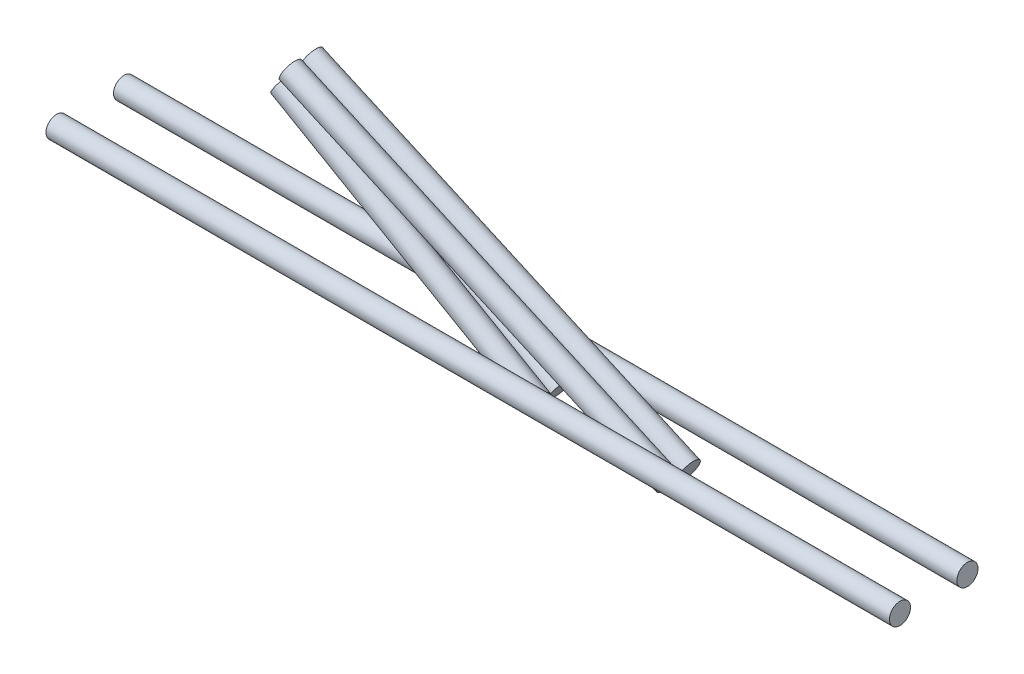
ISO-10303-21;
HEADER;
FILE_DESCRIPTION(('STEP AP214'),'2;1');
FILE_NAME('part.step','',(''),(''),'','','');
FILE_SCHEMA(('AUTOMOTIVE_DESIGN { 1 0 10303 214 1 1 1 1 }'));
ENDSEC;
DATA;
#1=APPLICATION_CONTEXT('core data for automotive mechanical design processes');
#2=APPLICATION_PROTOCOL_DEFINITION('international standard','automotive_design',2000,#1);
#3=PRODUCT_CONTEXT('',#1,'mechanical');
#4=PRODUCT('Part','Part','',(#3));
#5=PRODUCT_RELATED_PRODUCT_CATEGORY('part','',(#4));
#6=PRODUCT_DEFINITION_FORMATION('','',#4);
#7=PRODUCT_DEFINITION_CONTEXT('part definition',#1,'design');
#8=PRODUCT_DEFINITION('design','',#6,#7);
#9=PRODUCT_DEFINITION_SHAPE('','',#8);
#10=(LENGTH_UNIT() NAMED_UNIT(*) SI_UNIT(.MILLI.,.METRE.));
#11=(NAMED_UNIT(*) PLANE_ANGLE_UNIT() SI_UNIT($,.RADIAN.));
#12=(NAMED_UNIT(*) SI_UNIT($,.STERADIAN.) SOLID_ANGLE_UNIT());
#13=UNCERTAINTY_MEASURE_WITH_UNIT(LENGTH_MEASURE(1.E-05),#10,'distance_accuracy_value','');
#14=(GEOMETRIC_REPRESENTATION_CONTEXT(3) GLOBAL_UNCERTAINTY_ASSIGNED_CONTEXT((#13)) GLOBAL_UNIT_ASSIGNED_CONTEXT((#10,
#11,#12)) REPRESENTATION_CONTEXT('',''));
#15=CARTESIAN_POINT('',(0.,0.,0.));
#16=DIRECTION('',(0.,0.,1.));
#17=DIRECTION('',(1.,0.,0.));
#18=AXIS2_PLACEMENT_3D('',#15,#16,#17);
#19=CARTESIAN_POINT('',(179.312378994594,-5.04212259880112,-2.18412612996367));
#20=DIRECTION('',(-0.866025403784442,0.499999999999995,0.));
#21=DIRECTION('',(-0.499999999999995,-0.866025403784442,0.));
#22=AXIS2_PLACEMENT_3D('',#19,#20,#21);
#23=CYLINDRICAL_SURFACE('',#22,2.5);
#24=CARTESIAN_POINT('',(115.104050993091,34.2230497524854,-0.559871418825768));
#25=CARTESIAN_POINT('',(115.473625554557,34.0354542241354,-0.586015995103455));
#26=CARTESIAN_POINT('',(115.843140978074,33.8478798914817,-0.613193511793247));
#27=CARTESIAN_POINT('',(116.5821267339,33.472746897746,-0.670090157234197));
#28=CARTESIAN_POINT('',(116.951597017621,33.2851882591149,-0.699810062945634));
#29=CARTESIAN_POINT('',(117.692768127334,32.9089418915969,-0.762457080069502));
#30=CARTESIAN_POINT('',(118.064467642567,32.7202548493275,-0.795403998489148));
#31=CARTESIAN_POINT('',(118.80749406637,32.3430873633072,-0.865065476925569));
#32=CARTESIAN_POINT('',(119.178821048082,32.1546068777519,-0.901779025265106));
#33=CARTESIAN_POINT('',(119.920935172167,31.7779567975748,-0.980047675993186));
#34=CARTESIAN_POINT('',(120.291722475335,31.5897871059188,-1.02160074775706));
#35=CARTESIAN_POINT('',(120.847585439857,31.3077456552632,-1.08899531248582));
#36=CARTESIAN_POINT('',(121.032893658746,31.2137300414563,-1.11231459979988));
#37=CARTESIAN_POINT('',(121.403293604176,31.0258323687381,-1.16102034570132));
#38=CARTESIAN_POINT('',(121.588385342957,30.9319503022041,-1.18640668105717));
#39=CARTESIAN_POINT('',(121.957777441161,30.744620028398,-1.2396967023499));
#40=CARTESIAN_POINT('',(122.142078575091,30.6511713387371,-1.26759324995681));
#41=CARTESIAN_POINT('',(122.510310271541,30.4645079331999,-1.32678458616794));
#42=CARTESIAN_POINT('',(122.694240739435,30.3712932758654,-1.35808015225646));
#43=CARTESIAN_POINT('',(123.061211404658,30.1853834568575,-1.42532869506711));
#44=CARTESIAN_POINT('',(123.2442524807,30.092687755513,-1.46127517980317));
#45=CARTESIAN_POINT('',(123.517863938752,29.9542113488892,-1.52071553435589));
#46=CARTESIAN_POINT('',(123.608892795797,29.9081554632404,-1.54144478404082));
#47=CARTESIAN_POINT('',(123.790485900449,29.8163187298293,-1.58538095508052));
#48=CARTESIAN_POINT('',(123.881050200959,29.7705378506445,-1.60858758745129));
#49=CARTESIAN_POINT('',(124.016495698335,29.7021133955272,-1.64608350115951));
#50=CARTESIAN_POINT('',(124.061655180837,29.6793071316691,-1.6590545897744));
#51=CARTESIAN_POINT('',(124.151712352938,29.6338462713675,-1.6861334768353));
#52=CARTESIAN_POINT('',(124.19660997603,29.6111917132551,-1.70024155163338));
#53=CARTESIAN_POINT('',(124.330653676701,29.5435910240219,-1.74455325860269));
#54=CARTESIAN_POINT('',(124.419342804425,29.4989107376417,-1.7767954864535));
#55=CARTESIAN_POINT('',(124.549712640532,29.433382846131,-1.83329201868211));
#56=CARTESIAN_POINT('',(124.592767547861,29.4117678293447,-1.8535043457589));
#57=CARTESIAN_POINT('',(124.67742452408,29.369354340205,-1.89846834747043));
#58=CARTESIAN_POINT('',(124.719019192585,29.348559974924,-1.92324001796571));
#59=CARTESIAN_POINT('',(124.777975881295,29.319233462284,-1.96710888253725));
#60=CARTESIAN_POINT('',(124.797194406955,29.3097005870909,-1.9830045180676));
#61=CARTESIAN_POINT('',(124.832853122732,29.2921106777156,-2.01827020246889));
#62=CARTESIAN_POINT('',(124.849326934881,29.2840356635214,-2.03759110994062));
#63=CARTESIAN_POINT('',(124.867040407043,29.2754985418904,-2.06693228609796));
#64=CARTESIAN_POINT('',(124.871171730344,29.2735232580065,-2.0747075149984));
#65=CARTESIAN_POINT('',(124.878345460926,29.2701385274881,-2.09086632299069));
#66=CARTESIAN_POINT('',(124.881389330747,29.2687283205568,-2.09924906662088));
#67=CARTESIAN_POINT('',(124.885680964934,29.2668083109778,-2.11508031957993));
#68=CARTESIAN_POINT('',(124.887141380933,29.266188793862,-2.12245667599967));
#69=CARTESIAN_POINT('',(124.888921883082,29.2655343045831,-2.13737165987097));
#70=CARTESIAN_POINT('',(124.889242756748,29.2654989286687,-2.14491017163377));
#71=CARTESIAN_POINT('',(124.888711491831,29.2660255454609,-2.15992141490252));
#72=CARTESIAN_POINT('',(124.887859573167,29.2665874261669,-2.16739415847676));
#73=CARTESIAN_POINT('',(124.885086243141,29.2682523916905,-2.18207552172719));
#74=CARTESIAN_POINT('',(124.88316371986,29.2693560390402,-2.18928385848322));
#75=CARTESIAN_POINT('',(124.877413751369,29.2725800182802,-2.20632557755735));
#76=CARTESIAN_POINT('',(124.873122758475,29.2749334347539,-2.21595624147206));
#77=CARTESIAN_POINT('',(124.863266038294,29.2802759298721,-2.23434467819974));
#78=CARTESIAN_POINT('',(124.857696939693,29.2832666881421,-2.24310005294688));
#79=CARTESIAN_POINT('',(124.840391500832,29.292507968859,-2.26723113852377));
#80=CARTESIAN_POINT('',(124.827562421492,29.2992990651115,-2.28160021328611));
#81=CARTESIAN_POINT('',(124.800345061132,29.3136428637732,-2.30831879536916));
#82=CARTESIAN_POINT('',(124.785951445402,29.3211981654561,-2.32066100815436));
#83=CARTESIAN_POINT('',(124.738621167465,29.345983641767,-2.35777959130281));
#84=CARTESIAN_POINT('',(124.704020643366,29.3640175103809,-2.37985371529139));
#85=CARTESIAN_POINT('',(124.633112710065,29.4008953664215,-2.42034116826065));
#86=CARTESIAN_POINT('',(124.596799007418,29.4197423148664,-2.43873944849509));
#87=CARTESIAN_POINT('',(124.522952224239,29.4580207274581,-2.4732445879837));
#88=CARTESIAN_POINT('',(124.485411592862,29.4774557145734,-2.48933144674643));
#89=CARTESIAN_POINT('',(124.409857478936,29.5165380324885,-2.51973791113501));
#90=CARTESIAN_POINT('',(124.371845119128,29.536184848343,-2.53406106016346));
#91=CARTESIAN_POINT('',(124.25860030585,29.5946816318115,-2.57463816456185));
#92=CARTESIAN_POINT('',(124.182840970431,29.6337709448496,-2.59907055650117));
#93=CARTESIAN_POINT('',(124.030553783599,29.7122921782325,-2.64481713182246));
#94=CARTESIAN_POINT('',(123.954025639743,29.7517242281161,-2.66613007659868));
#95=CARTESIAN_POINT('',(123.723474631566,29.870463678496,-2.72685157659646));
#96=CARTESIAN_POINT('',(123.568745786795,29.9500799162751,-2.76295823935666));
#97=CARTESIAN_POINT('',(123.259203593542,30.1092752205166,-2.82981877986462));
#98=CARTESIAN_POINT('',(123.104394729742,30.1888523921158,-2.86059910511279));
#99=CARTESIAN_POINT('',(122.794374436894,30.3481606546827,-2.91854676413599));
#100=CARTESIAN_POINT('',(122.639163528162,30.4278915284122,-2.94571749310589));
#101=CARTESIAN_POINT('',(122.196848625702,30.6550543299568,-3.0193430516314));
#102=CARTESIAN_POINT('',(121.909316489899,30.8026625124232,-3.06265213392841));
#103=CARTESIAN_POINT('',(121.333573295363,31.09815689798,-3.14349755410922));
#104=CARTESIAN_POINT('',(121.045362177465,31.2460431250535,-3.18103336848726));
#105=CARTESIAN_POINT('',(120.468348142076,31.5420751452057,-3.25191226583466));
#106=CARTESIAN_POINT('',(120.179544978655,31.6902210389606,-3.28525291030264));
#107=CARTESIAN_POINT('',(119.601643647749,31.9866366002367,-3.34868486537738));
#108=CARTESIAN_POINT('',(119.312545475765,32.1349062696387,-3.37877612566586));
#109=CARTESIAN_POINT('',(118.444426614094,32.5801140774656,-3.46521889610248));
#110=CARTESIAN_POINT('',(117.865089972857,32.8771902333668,-3.5176795833322));
#111=CARTESIAN_POINT('',(116.706055470765,33.4715223883871,-3.61531559413779));
#112=CARTESIAN_POINT('',(116.126357704663,33.7687783399885,-3.66049236455358));
#113=CARTESIAN_POINT('',(115.477000226176,34.1017728571887,-3.70795008961606));
#114=CARTESIAN_POINT('',(115.407490387421,34.1374181699607,-3.71298977703645));
#115=CARTESIAN_POINT('',(115.268479637095,34.208704750077,-3.72298948346769));
#116=CARTESIAN_POINT('',(115.198978726334,34.2443460169047,-3.72794951741963));
#117=CARTESIAN_POINT('',(115.129475733723,34.2799886447411,-3.73287106542216));
#118=B_SPLINE_CURVE_WITH_KNOTS('',3,(#24,#25,#26,#27,#28,#29,#30,#31,#32,#33,#34,#35,#36,#37,
#38,#39,#40,#41,#42,#43,#44,#45,#46,#47,#48,#49,#50,#51,#52,#53,#54,#55,#56,#57,#58,#59,#60,#61,
#62,#63,#64,#65,#66,#67,#68,#69,#70,#71,#72,#73,#74,#75,#76,#77,#78,#79,#80,#81,#82,#83,#84,#85,
#86,#87,#88,#89,#90,#91,#92,#93,#94,#95,#96,#97,#98,#99,#100,#101,#102,#103,#104,#105,#106,#107,
#108,#109,#110,#111,#112,#113,#114,#115,#116,#117),.UNSPECIFIED.,.F.,.F.,(4,2,2,2,2,2,2,2,2,2,2,
2,2,2,2,2,2,2,2,2,2,2,2,2,2,2,2,2,2,2,2,2,2,2,2,2,2,2,2,2,2,2,2,2,2,2,4),(0.,1.2458554838038,
2.49209307361098,3.74652664020585,5.00062415682661,6.25419734734294,6.88148260043075,
7.50873048389607,8.13424785727818,8.75990861271844,9.38470527574725,9.69698911463745,
10.0092365656787,10.165903530657,10.3226086900963,10.6353549000205,10.7920458693525,
10.9494411604148,11.0294226227552,11.1083378708268,11.1353288299004,11.1622833503838,
11.1848187395352,11.2073385518436,11.2298541418592,11.2523931600664,11.284615540676,
11.3169239128789,11.377855031393,11.4390008463573,11.5729862231874,11.7075093702774,
11.843134244754,11.97848203374,12.2444121553782,12.5104475822735,13.0434327544614,
13.5736903521972,14.1034456026584,15.0816430294573,16.0599291045687,17.0387812208137,
18.0176484928823,19.9771063060523,21.9361744217708,22.1710114822157,22.4058039658209),.UNSPECIFIED.);
#119=CARTESIAN_POINT('',(119.782106158607,31.8484202608319,-0.965740478981522));
#120=VERTEX_POINT('',#119);
#121=CARTESIAN_POINT('',(119.802442124961,31.8836431877781,-3.32659488095254));
#122=VERTEX_POINT('',#121);
#123=EDGE_CURVE('E87',#120,#122,#118,.T.);
#124=ORIENTED_EDGE('',*,*,#123,.F.);
#125=CARTESIAN_POINT('',(118.690600729683,29.9578774011985,-2.18412612996367));
#126=DIRECTION('',(-0.866025403784442,0.499999999999995,0.));
#127=DIRECTION('',(-0.499999999999995,-0.866025403784442,0.));
#128=AXIS2_PLACEMENT_3D('',#125,#126,#127);
#129=CIRCLE('',#128,2.5);
#130=EDGE_CURVE('E82',#122,#120,#129,.T.);
#131=ORIENTED_EDGE('',*,*,#130,.F.);
#132=EDGE_LOOP('',(#124,#131));
#133=FACE_BOUND('',#132,.T.);
#134=CARTESIAN_POINT('',(179.312378994594,-5.04212259880112,-2.18412612996367));
#135=DIRECTION('',(-0.866025403784442,0.499999999999995,0.));
#136=DIRECTION('',(-0.499999999999995,-0.866025403784442,0.));
#137=AXIS2_PLACEMENT_3D('',#134,#135,#136);
#138=CIRCLE('',#137,2.5);
#139=CARTESIAN_POINT('',(178.062378994594,-7.20718610826223,-2.18412612996367));
#140=VERTEX_POINT('',#139);
#141=EDGE_CURVE('E76',#140,#140,#138,.T.);
#142=ORIENTED_EDGE('',*,*,#141,.T.);
#143=EDGE_LOOP('',(#142));
#144=FACE_BOUND('',#143,.T.);
#145=ADVANCED_FACE('F68',(#133,#144),#23,.T.);
#146=CARTESIAN_POINT('',(174.559359298053,-13.2745942025854,0.998376791333331));
#147=DIRECTION('',(-0.866025403784442,0.499999999999995,0.));
#148=DIRECTION('',(-0.499999999999995,-0.866025403784442,0.));
#149=AXIS2_PLACEMENT_3D('',#146,#147,#148);
#150=PLANE('',#149);
#151=ORIENTED_EDGE('',*,*,#141,.F.);
#152=EDGE_LOOP('',(#151));
#153=FACE_BOUND('',#152,.T.);
#154=ADVANCED_FACE('F115',(#153),#150,.F.);
#155=CARTESIAN_POINT('',(113.937581033142,21.7254057974143,0.998376791333331));
#156=DIRECTION('',(-0.866025403784442,0.499999999999995,0.));
#157=DIRECTION('',(-0.499999999999995,-0.866025403784442,0.));
#158=AXIS2_PLACEMENT_3D('',#155,#156,#157);
#159=PLANE('',#158);
#160=CARTESIAN_POINT('',(120.899892734075,33.7844834015622,-2.10841281893664));
#161=DIRECTION('',(-0.866025403784442,0.499999999999995,0.));
#162=DIRECTION('',(0.499999999999995,0.866025403784442,0.));
#163=AXIS2_PLACEMENT_3D('',#160,#161,#162);
#164=ELLIPSE('',#163,2.5134861130984,2.5);
#165=EDGE_CURVE('E13',#122,#120,#164,.T.);
#166=ORIENTED_EDGE('',*,*,#165,.F.);
#167=ORIENTED_EDGE('',*,*,#130,.T.);
#168=EDGE_LOOP('',(#166,#167));
#169=FACE_BOUND('',#168,.T.);
#170=ADVANCED_FACE('F84',(#169),#159,.T.);
#171=CARTESIAN_POINT('',(120.661434712941,33.8909612956451,-2.10841281893664));
#172=DIRECTION('',(0.913104496260852,-0.407725617184173,0.));
#173=DIRECTION('',(0.407725617184173,0.913104496260852,0.));
#174=AXIS2_PLACEMENT_3D('',#171,#172,#173);
#175=CYLINDRICAL_SURFACE('',#174,2.5);
#176=ORIENTED_EDGE('',*,*,#165,.T.);
#177=ORIENTED_EDGE('',*,*,#123,.T.);
#178=EDGE_LOOP('',(#176,#177));
#179=FACE_BOUND('',#178,.T.);
#180=CARTESIAN_POINT('',(120.661434712941,33.8909612956451,-2.10841281893664));
#181=DIRECTION('',(0.913104496260853,-0.407725617184173,0.));
#182=DIRECTION('',(0.407725617184173,0.913104496260853,0.));
#183=AXIS2_PLACEMENT_3D('',#180,#181,#182);
#184=CIRCLE('',#183,2.5);
#185=CARTESIAN_POINT('',(121.680748755902,36.1737225362972,-2.10841281893664));
#186=VERTEX_POINT('',#185);
#187=EDGE_CURVE('E91',#186,#186,#184,.T.);
#188=ORIENTED_EDGE('',*,*,#187,.T.);
#189=EDGE_LOOP('',(#188));
#190=FACE_BOUND('',#189,.T.);
#191=CARTESIAN_POINT('',(210.145675346505,-6.06614918840388,-2.10841281893664));
#192=DIRECTION('',(0.913104496260853,-0.407725617184173,0.));
#193=DIRECTION('',(0.407725617184173,0.913104496260853,0.));
#194=AXIS2_PLACEMENT_3D('',#191,#192,#193);
#195=CIRCLE('',#194,2.5);
#196=CARTESIAN_POINT('',(211.164989389465,-3.78338794775175,-2.10841281893664));
#197=VERTEX_POINT('',#196);
#198=EDGE_CURVE('E103',#197,#197,#195,.T.);
#199=ORIENTED_EDGE('',*,*,#198,.F.);
#200=EDGE_LOOP('',(#199));
#201=FACE_BOUND('',#200,.T.);
#202=ADVANCED_FACE('F93',(#179,#190,#201),#175,.T.);
#203=CARTESIAN_POINT('',(120.49793477433,33.524801989503,-8.43699537265665));
#204=DIRECTION('',(0.913104496260853,-0.407725617184173,0.));
#205=DIRECTION('',(0.407725617184173,0.913104496260853,0.));
#206=AXIS2_PLACEMENT_3D('',#203,#204,#205);
#207=PLANE('',#206);
#208=ORIENTED_EDGE('',*,*,#187,.F.);
#209=EDGE_LOOP('',(#208));
#210=FACE_BOUND('',#209,.T.);
#211=ADVANCED_FACE('F96',(#210),#207,.F.);
#212=CARTESIAN_POINT('',(209.982175407893,-6.43230849454598,-8.43699537265665));
#213=DIRECTION('',(0.913104496260853,-0.407725617184173,0.));
#214=DIRECTION('',(0.407725617184173,0.913104496260853,0.));
#215=AXIS2_PLACEMENT_3D('',#212,#213,#214);
#216=PLANE('',#215);
#217=ORIENTED_EDGE('',*,*,#198,.T.);
#218=EDGE_LOOP('',(#217));
#219=FACE_BOUND('',#218,.T.);
#220=ADVANCED_FACE('F150',(#219),#216,.T.);
#221=CLOSED_SHELL('',(#145,#154,#170,#202,#211,#220));
#222=MANIFOLD_SOLID_BREP('B2',#221);
#223=CARTESIAN_POINT('',(179.312378994594,-5.04212259880113,2.81587387003633));
#224=DIRECTION('',(-0.866025403784442,0.499999999999995,0.));
#225=DIRECTION('',(-0.499999999999995,-0.866025403784442,0.));
#226=AXIS2_PLACEMENT_3D('',#223,#224,#225);
#227=CYLINDRICAL_SURFACE('',#226,2.5);
#228=CARTESIAN_POINT('',(115.104050993091,34.2230497524854,4.44012858117423));
#229=CARTESIAN_POINT('',(115.473625554557,34.0354542241354,4.41398400489654));
#230=CARTESIAN_POINT('',(115.843140978074,33.8478798914817,4.38680648820675));
#231=CARTESIAN_POINT('',(116.5821267339,33.472746897746,4.3299098427658));
#232=CARTESIAN_POINT('',(116.951597017621,33.2851882591148,4.30018993705436));
#233=CARTESIAN_POINT('',(117.692768127334,32.9089418915969,4.23754291993049));
#234=CARTESIAN_POINT('',(118.064467642567,32.7202548493275,4.20459600151084));
#235=CARTESIAN_POINT('',(118.80749406637,32.3430873633072,4.13493452307443));
#236=CARTESIAN_POINT('',(119.178821048082,32.1546068777519,4.09822097473489));
#237=CARTESIAN_POINT('',(119.920935172167,31.7779567975748,4.01995232400682));
#238=CARTESIAN_POINT('',(120.291722475335,31.5897871059188,3.97839925224294));
#239=CARTESIAN_POINT('',(120.847585439857,31.3077456552632,3.91100468751418));
#240=CARTESIAN_POINT('',(121.032893658746,31.2137300414563,3.88768540020012));
#241=CARTESIAN_POINT('',(121.403293604176,31.0258323687381,3.83897965429868));
#242=CARTESIAN_POINT('',(121.588385342957,30.9319503022041,3.81359331894283));
#243=CARTESIAN_POINT('',(121.957777441161,30.744620028398,3.7603032976501));
#244=CARTESIAN_POINT('',(122.142078575091,30.6511713387371,3.73240675004319));
#245=CARTESIAN_POINT('',(122.510310271541,30.4645079331999,3.67321541383206));
#246=CARTESIAN_POINT('',(122.694240739435,30.3712932758654,3.64191984774355));
#247=CARTESIAN_POINT('',(123.061211404658,30.1853834568575,3.57467130493289));
#248=CARTESIAN_POINT('',(123.2442524807,30.092687755513,3.53872482019683));
#249=CARTESIAN_POINT('',(123.517863938752,29.9542113488892,3.47928446564411));
#250=CARTESIAN_POINT('',(123.608892795797,29.9081554632404,3.45855521595919));
#251=CARTESIAN_POINT('',(123.790485900449,29.8163187298293,3.41461904491948));
#252=CARTESIAN_POINT('',(123.881050200959,29.7705378506445,3.3914124125487));
#253=CARTESIAN_POINT('',(124.016495698335,29.7021133955272,3.35391649884048));
#254=CARTESIAN_POINT('',(124.061655180837,29.6793071316691,3.3409454102256));
#255=CARTESIAN_POINT('',(124.151712352938,29.6338462713675,3.3138665231647));
#256=CARTESIAN_POINT('',(124.19660997603,29.6111917132551,3.29975844836662));
#257=CARTESIAN_POINT('',(124.330653676701,29.5435910240219,3.2554467413973));
#258=CARTESIAN_POINT('',(124.419342804425,29.4989107376417,3.22320451354649));
#259=CARTESIAN_POINT('',(124.549712640532,29.433382846131,3.16670798131791));
#260=CARTESIAN_POINT('',(124.592767547861,29.4117678293447,3.14649565424113));
#261=CARTESIAN_POINT('',(124.67742452408,29.369354340205,3.10153165252959));
#262=CARTESIAN_POINT('',(124.719019192585,29.348559974924,3.07675998203428));
#263=CARTESIAN_POINT('',(124.777975881295,29.319233462284,3.03289111746272));
#264=CARTESIAN_POINT('',(124.797194406955,29.3097005870909,3.01699548193236));
#265=CARTESIAN_POINT('',(124.832853122732,29.2921106777156,2.98172979753111));
#266=CARTESIAN_POINT('',(124.849326934881,29.2840356635213,2.96240889005942));
#267=CARTESIAN_POINT('',(124.867040407043,29.2754985418904,2.93306771390206));
#268=CARTESIAN_POINT('',(124.871171730343,29.2735232580065,2.92529248500161));
#269=CARTESIAN_POINT('',(124.878345460926,29.2701385274881,2.90913367700932));
#270=CARTESIAN_POINT('',(124.881389330747,29.2687283205568,2.90075093337914));
#271=CARTESIAN_POINT('',(124.885680964934,29.2668083109778,2.88491968042009));
#272=CARTESIAN_POINT('',(124.887141380933,29.266188793862,2.87754332400035));
#273=CARTESIAN_POINT('',(124.888921883082,29.2655343045831,2.86262834012904));
#274=CARTESIAN_POINT('',(124.889242756748,29.2654989286686,2.85508982836625));
#275=CARTESIAN_POINT('',(124.888711491831,29.2660255454609,2.8400785850975));
#276=CARTESIAN_POINT('',(124.887859573167,29.2665874261669,2.83260584152325));
#277=CARTESIAN_POINT('',(124.885086243141,29.2682523916906,2.81792447827282));
#278=CARTESIAN_POINT('',(124.88316371986,29.2693560390402,2.81071614151679));
#279=CARTESIAN_POINT('',(124.877413751369,29.2725800182802,2.79367442244267));
#280=CARTESIAN_POINT('',(124.873122758475,29.2749334347539,2.78404375852796));
#281=CARTESIAN_POINT('',(124.863266038294,29.2802759298721,2.76565532180028));
#282=CARTESIAN_POINT('',(124.857696939693,29.2832666881421,2.75689994705314));
#283=CARTESIAN_POINT('',(124.840391500832,29.292507968859,2.73276886147625));
#284=CARTESIAN_POINT('',(124.827562421492,29.2992990651115,2.71839978671391));
#285=CARTESIAN_POINT('',(124.800345061132,29.3136428637732,2.69168120463088));
#286=CARTESIAN_POINT('',(124.785951445402,29.3211981654561,2.67933899184569));
#287=CARTESIAN_POINT('',(124.738621167465,29.345983641767,2.64222040869725));
#288=CARTESIAN_POINT('',(124.704020643366,29.3640175103808,2.62014628470865));
#289=CARTESIAN_POINT('',(124.633112710065,29.4008953664215,2.57965883173939));
#290=CARTESIAN_POINT('',(124.596799007418,29.4197423148663,2.56126055150499));
#291=CARTESIAN_POINT('',(124.522952224239,29.458020727458,2.5267554120164));
#292=CARTESIAN_POINT('',(124.485411592863,29.4774557145733,2.51066855325365));
#293=CARTESIAN_POINT('',(124.409857478937,29.5165380324884,2.48026208886507));
#294=CARTESIAN_POINT('',(124.371845119129,29.5361848483429,2.46593893983663));
#295=CARTESIAN_POINT('',(124.25860030585,29.5946816318113,2.42536183543827));
#296=CARTESIAN_POINT('',(124.182840970432,29.6337709448494,2.40092944349894));
#297=CARTESIAN_POINT('',(124.0305537836,29.7122921782322,2.35518286817767));
#298=CARTESIAN_POINT('',(123.954025639743,29.7517242281159,2.33386992340146));
#299=CARTESIAN_POINT('',(123.723474631567,29.8704636784956,2.2731484234037));
#300=CARTESIAN_POINT('',(123.568745786796,29.9500799162747,2.23704176064352));
#301=CARTESIAN_POINT('',(123.259203593543,30.1092752205161,2.17018122013557));
#302=CARTESIAN_POINT('',(123.104394729743,30.1888523921152,2.13940089488741));
#303=CARTESIAN_POINT('',(122.794374436895,30.3481606546821,2.08145323586423));
#304=CARTESIAN_POINT('',(122.639163528163,30.4278915284116,2.05428250689432));
#305=CARTESIAN_POINT('',(122.196848625704,30.6550543299562,1.9806569483688));
#306=CARTESIAN_POINT('',(121.9093164899,30.8026625124226,1.93734786607177));
#307=CARTESIAN_POINT('',(121.333573295364,31.0981568979794,1.85650244589093));
#308=CARTESIAN_POINT('',(121.045362177466,31.2460431250529,1.81896663151288));
#309=CARTESIAN_POINT('',(120.468348142077,31.5420751452052,1.74808773416545));
#310=CARTESIAN_POINT('',(120.179544978656,31.6902210389601,1.71474708969746));
#311=CARTESIAN_POINT('',(119.60164364775,31.9866366002362,1.65131513462271));
#312=CARTESIAN_POINT('',(119.312545475766,32.1349062696383,1.62122387433422));
#313=CARTESIAN_POINT('',(118.444426614095,32.5801140774652,1.53478110389757));
#314=CARTESIAN_POINT('',(117.865089972858,32.8771902333665,1.48232041666786));
#315=CARTESIAN_POINT('',(116.706055470765,33.4715223883869,1.38468440586224));
#316=CARTESIAN_POINT('',(116.126357704663,33.7687783399885,1.33950763544642));
#317=CARTESIAN_POINT('',(115.477000226177,34.1017728571886,1.29204991038395));
#318=CARTESIAN_POINT('',(115.407490387421,34.1374181699607,1.28701022296356));
#319=CARTESIAN_POINT('',(115.268479637095,34.2087047500769,1.27701051653232));
#320=CARTESIAN_POINT('',(115.198978726334,34.2443460169047,1.27205048258038));
#321=CARTESIAN_POINT('',(115.129475733723,34.2799886447411,1.26712893457783));
#322=B_SPLINE_CURVE_WITH_KNOTS('',3,(#228,#229,#230,#231,#232,#233,#234,#235,#236,#237,#238,
#239,#240,#241,#242,#243,#244,#245,#246,#247,#248,#249,#250,#251,#252,#253,#254,#255,#256,#257,
#258,#259,#260,#261,#262,#263,#264,#265,#266,#267,#268,#269,#270,#271,#272,#273,#274,#275,#276,
#277,#278,#279,#280,#281,#282,#283,#284,#285,#286,#287,#288,#289,#290,#291,#292,#293,#294,#295,
#296,#297,#298,#299,#300,#301,#302,#303,#304,#305,#306,#307,#308,#309,#310,#311,#312,#313,#314,
#315,#316,#317,#318,#319,#320,#321),.UNSPECIFIED.,.F.,.F.,(4,2,2,2,2,2,2,2,2,2,2,2,2,2,2,2,2,2,
2,2,2,2,2,2,2,2,2,2,2,2,2,2,2,2,2,2,2,2,2,2,2,2,2,2,2,2,4),(0.,1.24585548380384,
2.49209307361106,3.7465266402059,5.0006241568266,6.25419734734292,6.88148260043072,
7.50873048389602,8.13424785727814,8.75990861271842,9.38470527574723,9.69698911463741,
10.0092365656787,10.165903530657,10.3226086900963,10.6353549000205,10.7920458693525,
10.9494411604148,11.0294226227552,11.1083378708268,11.1353288299003,11.1622833503838,
11.1848187395351,11.2073385518436,11.2298541418592,11.2523931600664,11.2846155406759,
11.3169239128788,11.3778550313929,11.4390008463572,11.5729862231873,11.7075093702772,
11.8431342447537,11.9784820337396,12.2444121553777,12.5104475822728,13.0434327544604,
13.5736903521959,14.1034456026568,15.0816430294559,16.0599291045675,17.0387812208127,
18.0176484928815,19.9771063060518,21.9361744217706,22.1710114822157,22.4058039658209),.UNSPECIFIED.);
#323=CARTESIAN_POINT('',(119.782106158607,31.8484202608319,4.03425952101847));
#324=VERTEX_POINT('',#323);
#325=CARTESIAN_POINT('',(119.802442124961,31.8836431877781,1.67340511904746));
#326=VERTEX_POINT('',#325);
#327=EDGE_CURVE('E197',#324,#326,#322,.T.);
#328=ORIENTED_EDGE('',*,*,#327,.F.);
#329=CARTESIAN_POINT('',(118.690600729683,29.9578774011985,2.81587387003633));
#330=DIRECTION('',(-0.866025403784442,0.499999999999995,0.));
#331=DIRECTION('',(-0.499999999999995,-0.866025403784442,0.));
#332=AXIS2_PLACEMENT_3D('',#329,#330,#331);
#333=CIRCLE('',#332,2.5);
#334=EDGE_CURVE('E192',#326,#324,#333,.T.);
#335=ORIENTED_EDGE('',*,*,#334,.F.);
#336=EDGE_LOOP('',(#328,#335));
#337=FACE_BOUND('',#336,.T.);
#338=CARTESIAN_POINT('',(179.312378994594,-5.04212259880113,2.81587387003633));
#339=DIRECTION('',(-0.866025403784442,0.499999999999995,0.));
#340=DIRECTION('',(-0.499999999999995,-0.866025403784442,0.));
#341=AXIS2_PLACEMENT_3D('',#338,#339,#340);
#342=CIRCLE('',#341,2.5);
#343=CARTESIAN_POINT('',(178.062378994594,-7.20718610826223,2.81587387003633));
#344=VERTEX_POINT('',#343);
#345=EDGE_CURVE('E186',#344,#344,#342,.T.);
#346=ORIENTED_EDGE('',*,*,#345,.T.);
#347=EDGE_LOOP('',(#346));
#348=FACE_BOUND('',#347,.T.);
#349=ADVANCED_FACE('F178',(#337,#348),#227,.T.);
#350=CARTESIAN_POINT('',(174.559359298053,-13.2745942025854,0.998376791333331));
#351=DIRECTION('',(-0.866025403784442,0.499999999999995,0.));
#352=DIRECTION('',(-0.499999999999995,-0.866025403784442,0.));
#353=AXIS2_PLACEMENT_3D('',#350,#351,#352);
#354=PLANE('',#353);
#355=ORIENTED_EDGE('',*,*,#345,.F.);
#356=EDGE_LOOP('',(#355));
#357=FACE_BOUND('',#356,.T.);
#358=ADVANCED_FACE('F224',(#357),#354,.F.);
#359=CARTESIAN_POINT('',(113.937581033142,21.7254057974143,0.998376791333331));
#360=DIRECTION('',(-0.866025403784442,0.499999999999995,0.));
#361=DIRECTION('',(-0.499999999999995,-0.866025403784442,0.));
#362=AXIS2_PLACEMENT_3D('',#359,#360,#361);
#363=PLANE('',#362);
#364=CARTESIAN_POINT('',(120.899892734075,33.7844834015622,2.89158718106336));
#365=DIRECTION('',(-0.866025403784442,0.499999999999995,0.));
#366=DIRECTION('',(0.499999999999995,0.866025403784442,0.));
#367=AXIS2_PLACEMENT_3D('',#364,#365,#366);
#368=ELLIPSE('',#367,2.5134861130984,2.5);
#369=EDGE_CURVE('E66',#326,#324,#368,.T.);
#370=ORIENTED_EDGE('',*,*,#369,.F.);
#371=ORIENTED_EDGE('',*,*,#334,.T.);
#372=EDGE_LOOP('',(#370,#371));
#373=FACE_BOUND('',#372,.T.);
#374=ADVANCED_FACE('F194',(#373),#363,.T.);
#375=CARTESIAN_POINT('',(120.661434712941,33.8909612956451,2.89158718106336));
#376=DIRECTION('',(0.913104496260852,-0.407725617184173,0.));
#377=DIRECTION('',(0.407725617184173,0.913104496260852,0.));
#378=AXIS2_PLACEMENT_3D('',#375,#376,#377);
#379=CYLINDRICAL_SURFACE('',#378,2.5);
#380=CARTESIAN_POINT('',(210.145675346505,-6.06614918840387,2.89158718106336));
#381=DIRECTION('',(0.913104496260853,-0.407725617184173,0.));
#382=DIRECTION('',(0.407725617184173,0.913104496260853,0.));
#383=AXIS2_PLACEMENT_3D('',#380,#381,#382);
#384=CIRCLE('',#383,2.5);
#385=CARTESIAN_POINT('',(211.164989389465,-3.78338794775174,2.89158718106336));
#386=VERTEX_POINT('',#385);
#387=EDGE_CURVE('E212',#386,#386,#384,.T.);
#388=ORIENTED_EDGE('',*,*,#387,.F.);
#389=EDGE_LOOP('',(#388));
#390=FACE_BOUND('',#389,.T.);
#391=ORIENTED_EDGE('',*,*,#369,.T.);
#392=ORIENTED_EDGE('',*,*,#327,.T.);
#393=EDGE_LOOP('',(#391,#392));
#394=FACE_BOUND('',#393,.T.);
#395=CARTESIAN_POINT('',(120.661434712941,33.8909612956451,2.89158718106336));
#396=DIRECTION('',(0.913104496260853,-0.407725617184173,0.));
#397=DIRECTION('',(0.407725617184173,0.913104496260853,0.));
#398=AXIS2_PLACEMENT_3D('',#395,#396,#397);
#399=CIRCLE('',#398,2.5);
#400=CARTESIAN_POINT('',(121.680748755902,36.1737225362972,2.89158718106336));
#401=VERTEX_POINT('',#400);
#402=EDGE_CURVE('E201',#401,#401,#399,.T.);
#403=ORIENTED_EDGE('',*,*,#402,.T.);
#404=EDGE_LOOP('',(#403));
#405=FACE_BOUND('',#404,.T.);
#406=ADVANCED_FACE('F203',(#390,#394,#405),#379,.T.);
#407=CARTESIAN_POINT('',(120.49793477433,33.524801989503,-8.43699537265665));
#408=DIRECTION('',(0.913104496260853,-0.407725617184173,0.));
#409=DIRECTION('',(0.407725617184173,0.913104496260853,0.));
#410=AXIS2_PLACEMENT_3D('',#407,#408,#409);
#411=PLANE('',#410);
#412=ORIENTED_EDGE('',*,*,#402,.F.);
#413=EDGE_LOOP('',(#412));
#414=FACE_BOUND('',#413,.T.);
#415=ADVANCED_FACE('F206',(#414),#411,.F.);
#416=CARTESIAN_POINT('',(209.982175407893,-6.43230849454598,-8.43699537265665));
#417=DIRECTION('',(0.913104496260853,-0.407725617184173,0.));
#418=DIRECTION('',(0.407725617184173,0.913104496260853,0.));
#419=AXIS2_PLACEMENT_3D('',#416,#417,#418);
#420=PLANE('',#419);
#421=ORIENTED_EDGE('',*,*,#387,.T.);
#422=EDGE_LOOP('',(#421));
#423=FACE_BOUND('',#422,.T.);
#424=ADVANCED_FACE('F261',(#423),#420,.T.);
#425=CLOSED_SHELL('',(#349,#358,#374,#406,#415,#424));
#426=MANIFOLD_SOLID_BREP('B7',#425);
#427=CARTESIAN_POINT('',(270.676444450506,0.,8.39158718106336));
#428=DIRECTION('',(-1.,0.,0.));
#429=DIRECTION('',(0.,0.,1.));
#430=AXIS2_PLACEMENT_3D('',#427,#428,#429);
#431=CYLINDRICAL_SURFACE('',#430,2.5);
#432=CARTESIAN_POINT('',(270.676444450506,0.,8.39158718106336));
#433=DIRECTION('',(1.,0.,0.));
#434=DIRECTION('',(0.,0.,-1.));
#435=AXIS2_PLACEMENT_3D('',#432,#433,#434);
#436=CIRCLE('',#435,2.5);
#437=CARTESIAN_POINT('',(270.676444450506,0.,5.89158718106336));
#438=VERTEX_POINT('',#437);
#439=EDGE_CURVE('E177',#438,#438,#436,.T.);
#440=ORIENTED_EDGE('',*,*,#439,.F.);
#441=EDGE_LOOP('',(#440));
#442=FACE_BOUND('',#441,.T.);
#443=CARTESIAN_POINT('',(70.676444450506,0.,8.39158718106336));
#444=DIRECTION('',(1.,0.,0.));
#445=DIRECTION('',(0.,0.,-1.));
#446=AXIS2_PLACEMENT_3D('',#443,#444,#445);
#447=CIRCLE('',#446,2.5);
#448=CARTESIAN_POINT('',(70.676444450506,0.,5.89158718106336));
#449=VERTEX_POINT('',#448);
#450=EDGE_CURVE('E293',#449,#449,#447,.T.);
#451=ORIENTED_EDGE('',*,*,#450,.T.);
#452=EDGE_LOOP('',(#451));
#453=FACE_BOUND('',#452,.T.);
#454=ADVANCED_FACE('F287',(#442,#453),#431,.T.);
#455=CARTESIAN_POINT('',(270.676444450506,0.,8.39158718106336));
#456=DIRECTION('',(1.,0.,0.));
#457=DIRECTION('',(0.,0.,-1.));
#458=AXIS2_PLACEMENT_3D('',#455,#456,#457);
#459=PLANE('',#458);
#460=ORIENTED_EDGE('',*,*,#439,.T.);
#461=EDGE_LOOP('',(#460));
#462=FACE_BOUND('',#461,.T.);
#463=ADVANCED_FACE('F302',(#462),#459,.T.);
#464=CARTESIAN_POINT('',(70.676444450506,0.,8.39158718106336));
#465=DIRECTION('',(1.,0.,0.));
#466=DIRECTION('',(0.,0.,-1.));
#467=AXIS2_PLACEMENT_3D('',#464,#465,#466);
#468=PLANE('',#467);
#469=ORIENTED_EDGE('',*,*,#450,.F.);
#470=EDGE_LOOP('',(#469));
#471=FACE_BOUND('',#470,.T.);
#472=ADVANCED_FACE('F300',(#471),#468,.F.);
#473=CLOSED_SHELL('',(#454,#463,#472));
#474=MANIFOLD_SOLID_BREP('B60',#473);
#475=CARTESIAN_POINT('',(70.676444450506,0.,-7.60841281893664));
#476=DIRECTION('',(1.,0.,0.));
#477=DIRECTION('',(0.,0.,-1.));
#478=AXIS2_PLACEMENT_3D('',#475,#476,#477);
#479=CYLINDRICAL_SURFACE('',#478,2.5);
#480=CARTESIAN_POINT('',(70.676444450506,0.,-7.60841281893664));
#481=DIRECTION('',(1.,0.,0.));
#482=DIRECTION('',(0.,0.,-1.));
#483=AXIS2_PLACEMENT_3D('',#480,#481,#482);
#484=CIRCLE('',#483,2.5);
#485=CARTESIAN_POINT('',(70.676444450506,0.,-10.1084128189366));
#486=VERTEX_POINT('',#485);
#487=EDGE_CURVE('E286',#486,#486,#484,.T.);
#488=ORIENTED_EDGE('',*,*,#487,.T.);
#489=EDGE_LOOP('',(#488));
#490=FACE_BOUND('',#489,.T.);
#491=CARTESIAN_POINT('',(270.676444450506,0.,-7.60841281893664));
#492=DIRECTION('',(1.,0.,0.));
#493=DIRECTION('',(0.,0.,-1.));
#494=AXIS2_PLACEMENT_3D('',#491,#492,#493);
#495=CIRCLE('',#494,2.5);
#496=CARTESIAN_POINT('',(270.676444450506,0.,-10.1084128189366));
#497=VERTEX_POINT('',#496);
#498=EDGE_CURVE('E334',#497,#497,#495,.T.);
#499=ORIENTED_EDGE('',*,*,#498,.F.);
#500=EDGE_LOOP('',(#499));
#501=FACE_BOUND('',#500,.T.);
#502=ADVANCED_FACE('F328',(#490,#501),#479,.T.);
#503=CARTESIAN_POINT('',(70.676444450506,0.,-7.60841281893664));
#504=DIRECTION('',(1.,0.,0.));
#505=DIRECTION('',(0.,0.,-1.));
#506=AXIS2_PLACEMENT_3D('',#503,#504,#505);
#507=PLANE('',#506);
#508=ORIENTED_EDGE('',*,*,#487,.F.);
#509=EDGE_LOOP('',(#508));
#510=FACE_BOUND('',#509,.T.);
#511=ADVANCED_FACE('F343',(#510),#507,.F.);
#512=CARTESIAN_POINT('',(270.676444450506,0.,-7.60841281893664));
#513=DIRECTION('',(1.,0.,0.));
#514=DIRECTION('',(0.,0.,-1.));
#515=AXIS2_PLACEMENT_3D('',#512,#513,#514);
#516=PLANE('',#515);
#517=ORIENTED_EDGE('',*,*,#498,.T.);
#518=EDGE_LOOP('',(#517));
#519=FACE_BOUND('',#518,.T.);
#520=ADVANCED_FACE('F340',(#519),#516,.T.);
#521=CLOSED_SHELL('',(#502,#511,#520));
#522=MANIFOLD_SOLID_BREP('B172',#521);
#523=ADVANCED_BREP_SHAPE_REPRESENTATION('',(#18,#222,#426,#474,#522),#14);
#524=SHAPE_DEFINITION_REPRESENTATION(#9,#523);
ENDSEC;
END-ISO-10303-21;
